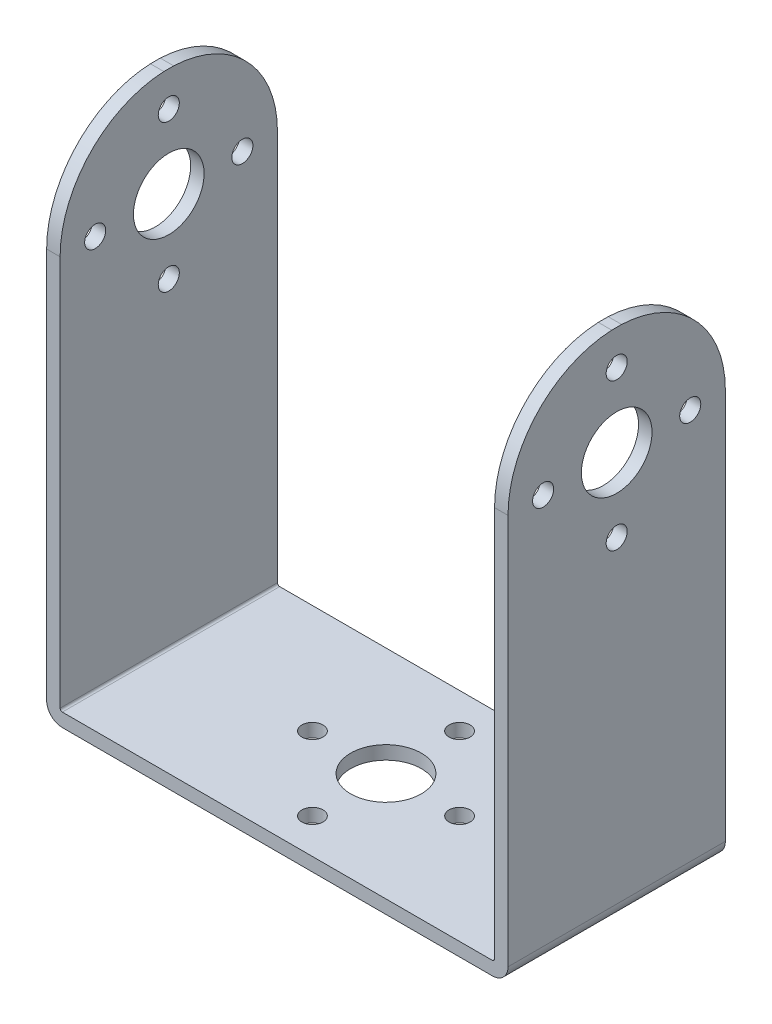
ISO-10303-21;
HEADER;
FILE_DESCRIPTION(('STEP AP214'),'2;1');
FILE_NAME('part.step','',(''),(''),'','','');
FILE_SCHEMA(('AUTOMOTIVE_DESIGN { 1 0 10303 214 1 1 1 1 }'));
ENDSEC;
DATA;
#1=APPLICATION_CONTEXT('core data for automotive mechanical design processes');
#2=APPLICATION_PROTOCOL_DEFINITION('international standard','automotive_design',2000,#1);
#3=PRODUCT_CONTEXT('',#1,'mechanical');
#4=PRODUCT('Part','Part','',(#3));
#5=PRODUCT_RELATED_PRODUCT_CATEGORY('part','',(#4));
#6=PRODUCT_DEFINITION_FORMATION('','',#4);
#7=PRODUCT_DEFINITION_CONTEXT('part definition',#1,'design');
#8=PRODUCT_DEFINITION('design','',#6,#7);
#9=PRODUCT_DEFINITION_SHAPE('','',#8);
#10=(LENGTH_UNIT() NAMED_UNIT(*) SI_UNIT(.MILLI.,.METRE.));
#11=(NAMED_UNIT(*) PLANE_ANGLE_UNIT() SI_UNIT($,.RADIAN.));
#12=(NAMED_UNIT(*) SI_UNIT($,.STERADIAN.) SOLID_ANGLE_UNIT());
#13=UNCERTAINTY_MEASURE_WITH_UNIT(LENGTH_MEASURE(1.E-05),#10,'distance_accuracy_value','');
#14=(GEOMETRIC_REPRESENTATION_CONTEXT(3) GLOBAL_UNCERTAINTY_ASSIGNED_CONTEXT((#13)) GLOBAL_UNIT_ASSIGNED_CONTEXT((#10,
#11,#12)) REPRESENTATION_CONTEXT('',''));
#15=CARTESIAN_POINT('',(0.,0.,0.));
#16=DIRECTION('',(0.,0.,1.));
#17=DIRECTION('',(1.,0.,0.));
#18=AXIS2_PLACEMENT_3D('',#15,#16,#17);
#19=CARTESIAN_POINT('',(-24.5999,58.3438,0.));
#20=DIRECTION('',(-1.,0.,0.));
#21=DIRECTION('',(0.,0.,1.));
#22=AXIS2_PLACEMENT_3D('',#19,#20,#21);
#23=PLANE('',#22);
#24=CARTESIAN_POINT('',(-24.5999,37.7317,0.));
#25=DIRECTION('',(-1.,0.,0.));
#26=DIRECTION('',(0.,0.,1.));
#27=AXIS2_PLACEMENT_3D('',#24,#25,#26);
#28=CIRCLE('',#27,1.1938);
#29=CARTESIAN_POINT('',(-24.5999,37.7317,1.1938));
#30=VERTEX_POINT('',#29);
#31=EDGE_CURVE('E472',#30,#30,#28,.T.);
#32=ORIENTED_EDGE('',*,*,#31,.T.);
#33=EDGE_LOOP('',(#32));
#34=FACE_BOUND('',#33,.T.);
#35=CARTESIAN_POINT('',(-24.5999,46.0629,8.3312));
#36=DIRECTION('',(-1.,0.,0.));
#37=DIRECTION('',(0.,0.,1.));
#38=AXIS2_PLACEMENT_3D('',#35,#36,#37);
#39=CIRCLE('',#38,1.1938);
#40=CARTESIAN_POINT('',(-24.5999,46.0629,9.525));
#41=VERTEX_POINT('',#40);
#42=EDGE_CURVE('E477',#41,#41,#39,.T.);
#43=ORIENTED_EDGE('',*,*,#42,.T.);
#44=EDGE_LOOP('',(#43));
#45=FACE_BOUND('',#44,.T.);
#46=CARTESIAN_POINT('',(-24.5999,54.3941,0.));
#47=DIRECTION('',(-1.,0.,0.));
#48=DIRECTION('',(0.,0.,1.));
#49=AXIS2_PLACEMENT_3D('',#46,#47,#48);
#50=CIRCLE('',#49,1.1938);
#51=CARTESIAN_POINT('',(-24.5999,54.3941,1.1938));
#52=VERTEX_POINT('',#51);
#53=EDGE_CURVE('E481',#52,#52,#50,.T.);
#54=ORIENTED_EDGE('',*,*,#53,.T.);
#55=EDGE_LOOP('',(#54));
#56=FACE_BOUND('',#55,.T.);
#57=CARTESIAN_POINT('',(-24.5999,46.0629,-8.3312));
#58=DIRECTION('',(-1.,0.,0.));
#59=DIRECTION('',(0.,0.,1.));
#60=AXIS2_PLACEMENT_3D('',#57,#58,#59);
#61=CIRCLE('',#60,1.1938);
#62=CARTESIAN_POINT('',(-24.5999,46.0629,-7.1374));
#63=VERTEX_POINT('',#62);
#64=EDGE_CURVE('E485',#63,#63,#61,.T.);
#65=ORIENTED_EDGE('',*,*,#64,.T.);
#66=EDGE_LOOP('',(#65));
#67=FACE_BOUND('',#66,.T.);
#68=CARTESIAN_POINT('',(-24.5999,46.0629,0.));
#69=DIRECTION('',(-1.,0.,0.));
#70=DIRECTION('',(0.,0.,1.));
#71=AXIS2_PLACEMENT_3D('',#68,#69,#70);
#72=CIRCLE('',#71,4.0005);
#73=CARTESIAN_POINT('',(-24.5999,46.0629,4.0005));
#74=VERTEX_POINT('',#73);
#75=EDGE_CURVE('E502',#74,#74,#72,.T.);
#76=ORIENTED_EDGE('',*,*,#75,.T.);
#77=EDGE_LOOP('',(#76));
#78=FACE_BOUND('',#77,.T.);
#79=DIRECTION('',(0.,-1.,0.));
#80=VECTOR('',#79,1.);
#81=CARTESIAN_POINT('',(-24.5999,58.3438,12.3063));
#82=LINE('',#81,#80);
#83=CARTESIAN_POINT('',(-24.5999,46.0502,12.3063));
#84=VERTEX_POINT('',#83);
#85=CARTESIAN_POINT('',(-24.5999,1.778,12.3063));
#86=VERTEX_POINT('',#85);
#87=EDGE_CURVE('E338',#84,#86,#82,.T.);
#88=ORIENTED_EDGE('',*,*,#87,.T.);
#89=DIRECTION('',(0.,0.,-1.));
#90=VECTOR('',#89,1.);
#91=CARTESIAN_POINT('',(-24.5999,1.778,0.));
#92=LINE('',#91,#90);
#93=CARTESIAN_POINT('',(-24.5999,1.778,-12.3063));
#94=VERTEX_POINT('',#93);
#95=EDGE_CURVE('E390',#86,#94,#92,.T.);
#96=ORIENTED_EDGE('',*,*,#95,.T.);
#97=DIRECTION('',(0.,-1.,0.));
#98=VECTOR('',#97,1.);
#99=CARTESIAN_POINT('',(-24.5999,58.3438,-12.3063));
#100=LINE('',#99,#98);
#101=CARTESIAN_POINT('',(-24.5999,46.0502,-12.3063));
#102=VERTEX_POINT('',#101);
#103=EDGE_CURVE('E321',#102,#94,#100,.T.);
#104=ORIENTED_EDGE('',*,*,#103,.F.);
#105=CARTESIAN_POINT('',(-24.5999,46.0502,0.));
#106=DIRECTION('',(-1.,0.,0.));
#107=DIRECTION('',(0.,0.,1.));
#108=AXIS2_PLACEMENT_3D('',#105,#106,#107);
#109=CIRCLE('',#108,12.3063);
#110=CARTESIAN_POINT('',(-24.5999,58.3438,-0.558944299550435));
#111=VERTEX_POINT('',#110);
#112=EDGE_CURVE('E301',#111,#102,#109,.T.);
#113=ORIENTED_EDGE('',*,*,#112,.F.);
#114=DIRECTION('',(0.,0.,-1.));
#115=VECTOR('',#114,1.);
#116=CARTESIAN_POINT('',(-24.5999,58.3438,0.));
#117=LINE('',#116,#115);
#118=CARTESIAN_POINT('',(-24.5999,58.3438,0.558944299550435));
#119=VERTEX_POINT('',#118);
#120=EDGE_CURVE('E311',#119,#111,#117,.T.);
#121=ORIENTED_EDGE('',*,*,#120,.F.);
#122=CARTESIAN_POINT('',(-24.5999,46.0502,0.));
#123=DIRECTION('',(-1.,0.,0.));
#124=DIRECTION('',(0.,0.,1.));
#125=AXIS2_PLACEMENT_3D('',#122,#123,#124);
#126=CIRCLE('',#125,12.3063);
#127=EDGE_CURVE('E458',#84,#119,#126,.T.);
#128=ORIENTED_EDGE('',*,*,#127,.F.);
#129=EDGE_LOOP('',(#88,#96,#104,#113,#121,#128));
#130=FACE_BOUND('',#129,.T.);
#131=ADVANCED_FACE('F177',(#34,#45,#56,#67,#78,#130),#23,.F.);
#132=CARTESIAN_POINT('',(-26.1239,58.3438,0.));
#133=DIRECTION('',(1.,0.,0.));
#134=DIRECTION('',(0.,0.,-1.));
#135=AXIS2_PLACEMENT_3D('',#132,#133,#134);
#136=PLANE('',#135);
#137=CARTESIAN_POINT('',(-26.1239,37.7317,0.));
#138=DIRECTION('',(1.,0.,0.));
#139=DIRECTION('',(0.,0.,-1.));
#140=AXIS2_PLACEMENT_3D('',#137,#138,#139);
#141=CIRCLE('',#140,1.1938);
#142=CARTESIAN_POINT('',(-26.1239,37.7317,-1.1938));
#143=VERTEX_POINT('',#142);
#144=EDGE_CURVE('E914',#143,#143,#141,.T.);
#145=ORIENTED_EDGE('',*,*,#144,.T.);
#146=EDGE_LOOP('',(#145));
#147=FACE_BOUND('',#146,.T.);
#148=CARTESIAN_POINT('',(-26.1239,46.0629,8.3312));
#149=DIRECTION('',(1.,0.,0.));
#150=DIRECTION('',(0.,0.,-1.));
#151=AXIS2_PLACEMENT_3D('',#148,#149,#150);
#152=CIRCLE('',#151,1.1938);
#153=CARTESIAN_POINT('',(-26.1239,46.0629,7.1374));
#154=VERTEX_POINT('',#153);
#155=EDGE_CURVE('E908',#154,#154,#152,.T.);
#156=ORIENTED_EDGE('',*,*,#155,.T.);
#157=EDGE_LOOP('',(#156));
#158=FACE_BOUND('',#157,.T.);
#159=CARTESIAN_POINT('',(-26.1239,54.3941,0.));
#160=DIRECTION('',(1.,0.,0.));
#161=DIRECTION('',(0.,0.,-1.));
#162=AXIS2_PLACEMENT_3D('',#159,#160,#161);
#163=CIRCLE('',#162,1.1938);
#164=CARTESIAN_POINT('',(-26.1239,54.3941,-1.1938));
#165=VERTEX_POINT('',#164);
#166=EDGE_CURVE('E888',#165,#165,#163,.T.);
#167=ORIENTED_EDGE('',*,*,#166,.T.);
#168=EDGE_LOOP('',(#167));
#169=FACE_BOUND('',#168,.T.);
#170=CARTESIAN_POINT('',(-26.1239,46.0629,-8.3312));
#171=DIRECTION('',(1.,0.,0.));
#172=DIRECTION('',(0.,0.,-1.));
#173=AXIS2_PLACEMENT_3D('',#170,#171,#172);
#174=CIRCLE('',#173,1.1938);
#175=CARTESIAN_POINT('',(-26.1239,46.0629,-9.525));
#176=VERTEX_POINT('',#175);
#177=EDGE_CURVE('E492',#176,#176,#174,.T.);
#178=ORIENTED_EDGE('',*,*,#177,.T.);
#179=EDGE_LOOP('',(#178));
#180=FACE_BOUND('',#179,.T.);
#181=CARTESIAN_POINT('',(-26.1239,46.0629,0.));
#182=DIRECTION('',(1.,0.,0.));
#183=DIRECTION('',(0.,0.,-1.));
#184=AXIS2_PLACEMENT_3D('',#181,#182,#183);
#185=CIRCLE('',#184,4.0005);
#186=CARTESIAN_POINT('',(-26.1239,46.0629,-4.0005));
#187=VERTEX_POINT('',#186);
#188=EDGE_CURVE('E489',#187,#187,#185,.T.);
#189=ORIENTED_EDGE('',*,*,#188,.T.);
#190=EDGE_LOOP('',(#189));
#191=FACE_BOUND('',#190,.T.);
#192=DIRECTION('',(0.,-1.,0.));
#193=VECTOR('',#192,1.);
#194=CARTESIAN_POINT('',(-26.1239,58.3438,-12.3063));
#195=LINE('',#194,#193);
#196=CARTESIAN_POINT('',(-26.1239,46.0502,-12.3063));
#197=VERTEX_POINT('',#196);
#198=CARTESIAN_POINT('',(-26.1239,1.778,-12.3063));
#199=VERTEX_POINT('',#198);
#200=EDGE_CURVE('E447',#197,#199,#195,.T.);
#201=ORIENTED_EDGE('',*,*,#200,.T.);
#202=DIRECTION('',(0.,0.,1.));
#203=VECTOR('',#202,1.);
#204=CARTESIAN_POINT('',(-26.1239,1.778,0.));
#205=LINE('',#204,#203);
#206=CARTESIAN_POINT('',(-26.1239,1.778,12.3063));
#207=VERTEX_POINT('',#206);
#208=EDGE_CURVE('E372',#199,#207,#205,.T.);
#209=ORIENTED_EDGE('',*,*,#208,.T.);
#210=DIRECTION('',(0.,-1.,0.));
#211=VECTOR('',#210,1.);
#212=CARTESIAN_POINT('',(-26.1239,58.3438,12.3063));
#213=LINE('',#212,#211);
#214=CARTESIAN_POINT('',(-26.1239,46.0502,12.3063));
#215=VERTEX_POINT('',#214);
#216=EDGE_CURVE('E448',#215,#207,#213,.T.);
#217=ORIENTED_EDGE('',*,*,#216,.F.);
#218=CARTESIAN_POINT('',(-26.1239,46.0502,0.));
#219=DIRECTION('',(1.,0.,0.));
#220=DIRECTION('',(0.,0.,-1.));
#221=AXIS2_PLACEMENT_3D('',#218,#219,#220);
#222=CIRCLE('',#221,12.3063);
#223=CARTESIAN_POINT('',(-26.1239,58.3438,0.558944299550435));
#224=VERTEX_POINT('',#223);
#225=EDGE_CURVE('E318',#224,#215,#222,.T.);
#226=ORIENTED_EDGE('',*,*,#225,.F.);
#227=DIRECTION('',(0.,0.,1.));
#228=VECTOR('',#227,1.);
#229=CARTESIAN_POINT('',(-26.1239,58.3438,0.));
#230=LINE('',#229,#228);
#231=CARTESIAN_POINT('',(-26.1239,58.3438,-0.558944299550435));
#232=VERTEX_POINT('',#231);
#233=EDGE_CURVE('E308',#232,#224,#230,.T.);
#234=ORIENTED_EDGE('',*,*,#233,.F.);
#235=CARTESIAN_POINT('',(-26.1239,46.0502,0.));
#236=DIRECTION('',(1.,0.,0.));
#237=DIRECTION('',(0.,0.,-1.));
#238=AXIS2_PLACEMENT_3D('',#235,#236,#237);
#239=CIRCLE('',#238,12.3063);
#240=EDGE_CURVE('E290',#197,#232,#239,.T.);
#241=ORIENTED_EDGE('',*,*,#240,.F.);
#242=EDGE_LOOP('',(#201,#209,#217,#226,#234,#241));
#243=FACE_BOUND('',#242,.T.);
#244=ADVANCED_FACE('F316',(#147,#158,#169,#180,#191,#243),#136,.F.);
#245=CARTESIAN_POINT('',(-45.0640846074071,58.3438,0.));
#246=DIRECTION('',(0.,1.,0.));
#247=DIRECTION('',(0.,0.,1.));
#248=AXIS2_PLACEMENT_3D('',#245,#246,#247);
#249=PLANE('',#248);
#250=ORIENTED_EDGE('',*,*,#120,.T.);
#251=DIRECTION('',(1.,0.,0.));
#252=VECTOR('',#251,1.);
#253=CARTESIAN_POINT('',(-40.8686,58.3438,-0.558944299550435));
#254=LINE('',#253,#252);
#255=EDGE_CURVE('E293',#232,#111,#254,.T.);
#256=ORIENTED_EDGE('',*,*,#255,.F.);
#257=ORIENTED_EDGE('',*,*,#233,.T.);
#258=DIRECTION('',(1.,0.,0.));
#259=VECTOR('',#258,1.);
#260=CARTESIAN_POINT('',(-40.8686,58.3438,0.558944299550435));
#261=LINE('',#260,#259);
#262=EDGE_CURVE('E510',#224,#119,#261,.T.);
#263=ORIENTED_EDGE('',*,*,#262,.T.);
#264=EDGE_LOOP('',(#250,#256,#257,#263));
#265=FACE_BOUND('',#264,.T.);
#266=ADVANCED_FACE('F306',(#265),#249,.T.);
#267=CARTESIAN_POINT('',(24.5999,58.3438,0.));
#268=DIRECTION('',(-1.,0.,0.));
#269=DIRECTION('',(0.,0.,1.));
#270=AXIS2_PLACEMENT_3D('',#267,#268,#269);
#271=PLANE('',#270);
#272=CARTESIAN_POINT('',(24.5999,37.7317,0.));
#273=DIRECTION('',(-1.,0.,0.));
#274=DIRECTION('',(0.,0.,1.));
#275=AXIS2_PLACEMENT_3D('',#272,#273,#274);
#276=CIRCLE('',#275,1.1938);
#277=CARTESIAN_POINT('',(24.5999,37.7317,1.1938));
#278=VERTEX_POINT('',#277);
#279=EDGE_CURVE('E467',#278,#278,#276,.T.);
#280=ORIENTED_EDGE('',*,*,#279,.F.);
#281=EDGE_LOOP('',(#280));
#282=FACE_BOUND('',#281,.T.);
#283=CARTESIAN_POINT('',(24.5999,46.0629,8.3312));
#284=DIRECTION('',(-1.,0.,0.));
#285=DIRECTION('',(0.,0.,1.));
#286=AXIS2_PLACEMENT_3D('',#283,#284,#285);
#287=CIRCLE('',#286,1.1938);
#288=CARTESIAN_POINT('',(24.5999,46.0629,9.525));
#289=VERTEX_POINT('',#288);
#290=EDGE_CURVE('E471',#289,#289,#287,.T.);
#291=ORIENTED_EDGE('',*,*,#290,.F.);
#292=EDGE_LOOP('',(#291));
#293=FACE_BOUND('',#292,.T.);
#294=CARTESIAN_POINT('',(24.5999,54.3941,0.));
#295=DIRECTION('',(-1.,0.,0.));
#296=DIRECTION('',(0.,0.,1.));
#297=AXIS2_PLACEMENT_3D('',#294,#295,#296);
#298=CIRCLE('',#297,1.1938);
#299=CARTESIAN_POINT('',(24.5999,54.3941,1.1938));
#300=VERTEX_POINT('',#299);
#301=EDGE_CURVE('E476',#300,#300,#298,.T.);
#302=ORIENTED_EDGE('',*,*,#301,.F.);
#303=EDGE_LOOP('',(#302));
#304=FACE_BOUND('',#303,.T.);
#305=CARTESIAN_POINT('',(24.5999,46.0629,-8.3312));
#306=DIRECTION('',(-1.,0.,0.));
#307=DIRECTION('',(0.,0.,1.));
#308=AXIS2_PLACEMENT_3D('',#305,#306,#307);
#309=CIRCLE('',#308,1.1938);
#310=CARTESIAN_POINT('',(24.5999,46.0629,-7.1374));
#311=VERTEX_POINT('',#310);
#312=EDGE_CURVE('E480',#311,#311,#309,.T.);
#313=ORIENTED_EDGE('',*,*,#312,.F.);
#314=EDGE_LOOP('',(#313));
#315=FACE_BOUND('',#314,.T.);
#316=CARTESIAN_POINT('',(24.5999,46.0629,0.));
#317=DIRECTION('',(-1.,0.,0.));
#318=DIRECTION('',(0.,0.,1.));
#319=AXIS2_PLACEMENT_3D('',#316,#317,#318);
#320=CIRCLE('',#319,4.0005);
#321=CARTESIAN_POINT('',(24.5999,46.0629,4.0005));
#322=VERTEX_POINT('',#321);
#323=EDGE_CURVE('E484',#322,#322,#320,.T.);
#324=ORIENTED_EDGE('',*,*,#323,.F.);
#325=EDGE_LOOP('',(#324));
#326=FACE_BOUND('',#325,.T.);
#327=DIRECTION('',(0.,-1.,0.));
#328=VECTOR('',#327,1.);
#329=CARTESIAN_POINT('',(24.5999,58.3438,-12.3063));
#330=LINE('',#329,#328);
#331=CARTESIAN_POINT('',(24.5999,46.0502,-12.3063));
#332=VERTEX_POINT('',#331);
#333=CARTESIAN_POINT('',(24.5999,1.778,-12.3063));
#334=VERTEX_POINT('',#333);
#335=EDGE_CURVE('E339',#332,#334,#330,.T.);
#336=ORIENTED_EDGE('',*,*,#335,.T.);
#337=DIRECTION('',(0.,0.,-1.));
#338=VECTOR('',#337,1.);
#339=CARTESIAN_POINT('',(24.5999,1.778,12.3063));
#340=LINE('',#339,#338);
#341=CARTESIAN_POINT('',(24.5999,1.778,12.3063));
#342=VERTEX_POINT('',#341);
#343=EDGE_CURVE('E383',#334,#342,#340,.F.);
#344=ORIENTED_EDGE('',*,*,#343,.T.);
#345=DIRECTION('',(0.,-1.,0.));
#346=VECTOR('',#345,1.);
#347=CARTESIAN_POINT('',(24.5999,58.3438,12.3063));
#348=LINE('',#347,#346);
#349=CARTESIAN_POINT('',(24.5999,46.0502,12.3063));
#350=VERTEX_POINT('',#349);
#351=EDGE_CURVE('E319',#350,#342,#348,.T.);
#352=ORIENTED_EDGE('',*,*,#351,.F.);
#353=CARTESIAN_POINT('',(24.5999,46.0502,0.));
#354=DIRECTION('',(-1.,0.,0.));
#355=DIRECTION('',(0.,0.,1.));
#356=AXIS2_PLACEMENT_3D('',#353,#354,#355);
#357=CIRCLE('',#356,12.3063);
#358=CARTESIAN_POINT('',(24.5999,58.3438,0.558944299550435));
#359=VERTEX_POINT('',#358);
#360=EDGE_CURVE('E516',#350,#359,#357,.T.);
#361=ORIENTED_EDGE('',*,*,#360,.T.);
#362=DIRECTION('',(0.,0.,-1.));
#363=VECTOR('',#362,1.);
#364=CARTESIAN_POINT('',(24.5999,58.3438,0.));
#365=LINE('',#364,#363);
#366=CARTESIAN_POINT('',(24.5999,58.3438,-0.558944299550435));
#367=VERTEX_POINT('',#366);
#368=EDGE_CURVE('E520',#359,#367,#365,.T.);
#369=ORIENTED_EDGE('',*,*,#368,.T.);
#370=CARTESIAN_POINT('',(24.5999,46.0502,0.));
#371=DIRECTION('',(-1.,0.,0.));
#372=DIRECTION('',(0.,0.,1.));
#373=AXIS2_PLACEMENT_3D('',#370,#371,#372);
#374=CIRCLE('',#373,12.3063);
#375=EDGE_CURVE('E302',#367,#332,#374,.T.);
#376=ORIENTED_EDGE('',*,*,#375,.T.);
#377=EDGE_LOOP('',(#336,#344,#352,#361,#369,#376));
#378=FACE_BOUND('',#377,.T.);
#379=ADVANCED_FACE('F529',(#282,#293,#304,#315,#326,#378),#271,.T.);
#380=CARTESIAN_POINT('',(26.1239,58.3438,0.));
#381=DIRECTION('',(1.,0.,0.));
#382=DIRECTION('',(0.,0.,-1.));
#383=AXIS2_PLACEMENT_3D('',#380,#381,#382);
#384=PLANE('',#383);
#385=CARTESIAN_POINT('',(26.1239,37.7317,0.));
#386=DIRECTION('',(1.,0.,0.));
#387=DIRECTION('',(0.,0.,-1.));
#388=AXIS2_PLACEMENT_3D('',#385,#386,#387);
#389=CIRCLE('',#388,1.1938);
#390=CARTESIAN_POINT('',(26.1239,37.7317,-1.1938));
#391=VERTEX_POINT('',#390);
#392=EDGE_CURVE('E464',#391,#391,#389,.T.);
#393=ORIENTED_EDGE('',*,*,#392,.F.);
#394=EDGE_LOOP('',(#393));
#395=FACE_BOUND('',#394,.T.);
#396=CARTESIAN_POINT('',(26.1239,46.0629,8.3312));
#397=DIRECTION('',(1.,0.,0.));
#398=DIRECTION('',(0.,0.,-1.));
#399=AXIS2_PLACEMENT_3D('',#396,#397,#398);
#400=CIRCLE('',#399,1.1938);
#401=CARTESIAN_POINT('',(26.1239,46.0629,7.1374));
#402=VERTEX_POINT('',#401);
#403=EDGE_CURVE('E468',#402,#402,#400,.T.);
#404=ORIENTED_EDGE('',*,*,#403,.F.);
#405=EDGE_LOOP('',(#404));
#406=FACE_BOUND('',#405,.T.);
#407=CARTESIAN_POINT('',(26.1239,54.3941,0.));
#408=DIRECTION('',(1.,0.,0.));
#409=DIRECTION('',(0.,0.,-1.));
#410=AXIS2_PLACEMENT_3D('',#407,#408,#409);
#411=CIRCLE('',#410,1.1938);
#412=CARTESIAN_POINT('',(26.1239,54.3941,-1.1938));
#413=VERTEX_POINT('',#412);
#414=EDGE_CURVE('E473',#413,#413,#411,.T.);
#415=ORIENTED_EDGE('',*,*,#414,.F.);
#416=EDGE_LOOP('',(#415));
#417=FACE_BOUND('',#416,.T.);
#418=CARTESIAN_POINT('',(26.1239,46.0629,-8.3312));
#419=DIRECTION('',(1.,0.,0.));
#420=DIRECTION('',(0.,0.,-1.));
#421=AXIS2_PLACEMENT_3D('',#418,#419,#420);
#422=CIRCLE('',#421,1.1938);
#423=CARTESIAN_POINT('',(26.1239,46.0629,-9.525));
#424=VERTEX_POINT('',#423);
#425=EDGE_CURVE('E478',#424,#424,#422,.T.);
#426=ORIENTED_EDGE('',*,*,#425,.F.);
#427=EDGE_LOOP('',(#426));
#428=FACE_BOUND('',#427,.T.);
#429=CARTESIAN_POINT('',(26.1239,46.0629,0.));
#430=DIRECTION('',(1.,0.,0.));
#431=DIRECTION('',(0.,0.,-1.));
#432=AXIS2_PLACEMENT_3D('',#429,#430,#431);
#433=CIRCLE('',#432,4.0005);
#434=CARTESIAN_POINT('',(26.1239,46.0629,-4.0005));
#435=VERTEX_POINT('',#434);
#436=EDGE_CURVE('E482',#435,#435,#433,.T.);
#437=ORIENTED_EDGE('',*,*,#436,.F.);
#438=EDGE_LOOP('',(#437));
#439=FACE_BOUND('',#438,.T.);
#440=DIRECTION('',(0.,-1.,0.));
#441=VECTOR('',#440,1.);
#442=CARTESIAN_POINT('',(26.1239,58.3438,12.3063));
#443=LINE('',#442,#441);
#444=CARTESIAN_POINT('',(26.1239,46.0502,12.3063));
#445=VERTEX_POINT('',#444);
#446=CARTESIAN_POINT('',(26.1239,1.778,12.3063));
#447=VERTEX_POINT('',#446);
#448=EDGE_CURVE('E324',#445,#447,#443,.T.);
#449=ORIENTED_EDGE('',*,*,#448,.T.);
#450=DIRECTION('',(0.,0.,1.));
#451=VECTOR('',#450,1.);
#452=CARTESIAN_POINT('',(26.1239,1.778,-12.3063));
#453=LINE('',#452,#451);
#454=CARTESIAN_POINT('',(26.1239,1.778,-12.3063));
#455=VERTEX_POINT('',#454);
#456=EDGE_CURVE('E12',#447,#455,#453,.F.);
#457=ORIENTED_EDGE('',*,*,#456,.T.);
#458=DIRECTION('',(0.,-1.,0.));
#459=VECTOR('',#458,1.);
#460=CARTESIAN_POINT('',(26.1239,58.3438,-12.3063));
#461=LINE('',#460,#459);
#462=CARTESIAN_POINT('',(26.1239,46.0502,-12.3063));
#463=VERTEX_POINT('',#462);
#464=EDGE_CURVE('E343',#463,#455,#461,.T.);
#465=ORIENTED_EDGE('',*,*,#464,.F.);
#466=CARTESIAN_POINT('',(26.1239,46.0502,0.));
#467=DIRECTION('',(1.,0.,0.));
#468=DIRECTION('',(0.,0.,-1.));
#469=AXIS2_PLACEMENT_3D('',#466,#467,#468);
#470=CIRCLE('',#469,12.3063);
#471=CARTESIAN_POINT('',(26.1239,58.3438,-0.558944299550435));
#472=VERTEX_POINT('',#471);
#473=EDGE_CURVE('E312',#463,#472,#470,.T.);
#474=ORIENTED_EDGE('',*,*,#473,.T.);
#475=DIRECTION('',(0.,0.,1.));
#476=VECTOR('',#475,1.);
#477=CARTESIAN_POINT('',(26.1239,58.3438,0.));
#478=LINE('',#477,#476);
#479=CARTESIAN_POINT('',(26.1239,58.3438,0.558944299550435));
#480=VERTEX_POINT('',#479);
#481=EDGE_CURVE('E344',#472,#480,#478,.T.);
#482=ORIENTED_EDGE('',*,*,#481,.T.);
#483=CARTESIAN_POINT('',(26.1239,46.0502,0.));
#484=DIRECTION('',(1.,0.,0.));
#485=DIRECTION('',(0.,0.,-1.));
#486=AXIS2_PLACEMENT_3D('',#483,#484,#485);
#487=CIRCLE('',#486,12.3063);
#488=EDGE_CURVE('E355',#480,#445,#487,.T.);
#489=ORIENTED_EDGE('',*,*,#488,.T.);
#490=EDGE_LOOP('',(#449,#457,#465,#474,#482,#489));
#491=FACE_BOUND('',#490,.T.);
#492=ADVANCED_FACE('F353',(#395,#406,#417,#428,#439,#491),#384,.T.);
#493=CARTESIAN_POINT('',(-45.0640846074071,58.3438,0.));
#494=DIRECTION('',(0.,1.,0.));
#495=DIRECTION('',(0.,0.,1.));
#496=AXIS2_PLACEMENT_3D('',#493,#494,#495);
#497=PLANE('',#496);
#498=ORIENTED_EDGE('',*,*,#481,.F.);
#499=EDGE_CURVE('E313',#367,#472,#254,.T.);
#500=ORIENTED_EDGE('',*,*,#499,.F.);
#501=ORIENTED_EDGE('',*,*,#368,.F.);
#502=DIRECTION('',(1.,0.,0.));
#503=VECTOR('',#502,1.);
#504=CARTESIAN_POINT('',(-40.8686,58.3438,0.558944299550435));
#505=LINE('',#504,#503);
#506=EDGE_CURVE('E405',#359,#480,#505,.T.);
#507=ORIENTED_EDGE('',*,*,#506,.T.);
#508=EDGE_LOOP('',(#498,#500,#501,#507));
#509=FACE_BOUND('',#508,.T.);
#510=ADVANCED_FACE('F593',(#509),#497,.T.);
#511=CARTESIAN_POINT('',(-45.0640846074071,1.524,-12.3063));
#512=DIRECTION('',(0.,0.,-1.));
#513=DIRECTION('',(-1.,0.,0.));
#514=AXIS2_PLACEMENT_3D('',#511,#512,#513);
#515=PLANE('',#514);
#516=DIRECTION('',(1.,0.,0.));
#517=VECTOR('',#516,1.);
#518=CARTESIAN_POINT('',(-45.0640846074071,0.,-12.3063));
#519=LINE('',#518,#517);
#520=CARTESIAN_POINT('',(-24.3459,0.,-12.3063));
#521=VERTEX_POINT('',#520);
#522=CARTESIAN_POINT('',(24.3459,0.,-12.3063));
#523=VERTEX_POINT('',#522);
#524=EDGE_CURVE('E439',#521,#523,#519,.T.);
#525=ORIENTED_EDGE('',*,*,#524,.F.);
#526=CARTESIAN_POINT('',(-24.3459,1.778,-12.3063));
#527=DIRECTION('',(0.,0.,-1.));
#528=DIRECTION('',(-1.,0.,0.));
#529=AXIS2_PLACEMENT_3D('',#526,#527,#528);
#530=CIRCLE('',#529,1.778);
#531=EDGE_CURVE('E185',#521,#199,#530,.T.);
#532=ORIENTED_EDGE('',*,*,#531,.T.);
#533=ORIENTED_EDGE('',*,*,#200,.F.);
#534=DIRECTION('',(1.,0.,0.));
#535=VECTOR('',#534,1.);
#536=CARTESIAN_POINT('',(-40.8686,46.0502,-12.3063));
#537=LINE('',#536,#535);
#538=EDGE_CURVE('E296',#197,#102,#537,.T.);
#539=ORIENTED_EDGE('',*,*,#538,.T.);
#540=ORIENTED_EDGE('',*,*,#103,.T.);
#541=CARTESIAN_POINT('',(-24.3459,1.778,-12.3063));
#542=DIRECTION('',(0.,0.,-1.));
#543=DIRECTION('',(-1.,0.,0.));
#544=AXIS2_PLACEMENT_3D('',#541,#542,#543);
#545=CIRCLE('',#544,0.254);
#546=CARTESIAN_POINT('',(-24.3459,1.524,-12.3063));
#547=VERTEX_POINT('',#546);
#548=EDGE_CURVE('E381',#94,#547,#545,.F.);
#549=ORIENTED_EDGE('',*,*,#548,.T.);
#550=DIRECTION('',(1.,0.,0.));
#551=VECTOR('',#550,1.);
#552=CARTESIAN_POINT('',(-45.0640846074071,1.524,-12.3063));
#553=LINE('',#552,#551);
#554=CARTESIAN_POINT('',(24.3459,1.524,-12.3063));
#555=VERTEX_POINT('',#554);
#556=EDGE_CURVE('E391',#547,#555,#553,.T.);
#557=ORIENTED_EDGE('',*,*,#556,.T.);
#558=CARTESIAN_POINT('',(24.3459,1.778,-12.3063));
#559=DIRECTION('',(0.,0.,-1.));
#560=DIRECTION('',(-1.,0.,0.));
#561=AXIS2_PLACEMENT_3D('',#558,#559,#560);
#562=CIRCLE('',#561,0.254);
#563=EDGE_CURVE('E377',#555,#334,#562,.F.);
#564=ORIENTED_EDGE('',*,*,#563,.T.);
#565=ORIENTED_EDGE('',*,*,#335,.F.);
#566=EDGE_CURVE('E345',#332,#463,#537,.T.);
#567=ORIENTED_EDGE('',*,*,#566,.T.);
#568=ORIENTED_EDGE('',*,*,#464,.T.);
#569=CARTESIAN_POINT('',(24.3459,1.778,-12.3063));
#570=DIRECTION('',(0.,0.,-1.));
#571=DIRECTION('',(-1.,0.,0.));
#572=AXIS2_PLACEMENT_3D('',#569,#570,#571);
#573=CIRCLE('',#572,1.778);
#574=EDGE_CURVE('E197',#455,#523,#573,.T.);
#575=ORIENTED_EDGE('',*,*,#574,.T.);
#576=EDGE_LOOP('',(#525,#532,#533,#539,#540,#549,#557,#564,#565,#567,#568,#575));
#577=FACE_BOUND('',#576,.T.);
#578=ADVANCED_FACE('F541',(#577),#515,.T.);
#579=CARTESIAN_POINT('',(-45.0640846074071,1.524,12.3063));
#580=DIRECTION('',(0.,0.,1.));
#581=DIRECTION('',(1.,0.,0.));
#582=AXIS2_PLACEMENT_3D('',#579,#580,#581);
#583=PLANE('',#582);
#584=ORIENTED_EDGE('',*,*,#216,.T.);
#585=CARTESIAN_POINT('',(-24.3459,1.778,12.3063));
#586=DIRECTION('',(0.,0.,1.));
#587=DIRECTION('',(1.,0.,0.));
#588=AXIS2_PLACEMENT_3D('',#585,#586,#587);
#589=CIRCLE('',#588,1.778);
#590=CARTESIAN_POINT('',(-24.3459,0.,12.3063));
#591=VERTEX_POINT('',#590);
#592=EDGE_CURVE('E369',#207,#591,#589,.T.);
#593=ORIENTED_EDGE('',*,*,#592,.T.);
#594=DIRECTION('',(-1.,0.,0.));
#595=VECTOR('',#594,1.);
#596=CARTESIAN_POINT('',(-45.0640846074071,0.,12.3063));
#597=LINE('',#596,#595);
#598=CARTESIAN_POINT('',(24.3459,0.,12.3063));
#599=VERTEX_POINT('',#598);
#600=EDGE_CURVE('E441',#599,#591,#597,.T.);
#601=ORIENTED_EDGE('',*,*,#600,.F.);
#602=CARTESIAN_POINT('',(24.3459,1.778,12.3063));
#603=DIRECTION('',(0.,0.,1.));
#604=DIRECTION('',(1.,0.,0.));
#605=AXIS2_PLACEMENT_3D('',#602,#603,#604);
#606=CIRCLE('',#605,1.778);
#607=EDGE_CURVE('E361',#599,#447,#606,.T.);
#608=ORIENTED_EDGE('',*,*,#607,.T.);
#609=ORIENTED_EDGE('',*,*,#448,.F.);
#610=DIRECTION('',(1.,0.,0.));
#611=VECTOR('',#610,1.);
#612=CARTESIAN_POINT('',(-40.8686,46.0502,12.3063));
#613=LINE('',#612,#611);
#614=EDGE_CURVE('E511',#350,#445,#613,.T.);
#615=ORIENTED_EDGE('',*,*,#614,.F.);
#616=ORIENTED_EDGE('',*,*,#351,.T.);
#617=CARTESIAN_POINT('',(24.3459,1.778,12.3063));
#618=DIRECTION('',(0.,0.,1.));
#619=DIRECTION('',(1.,0.,0.));
#620=AXIS2_PLACEMENT_3D('',#617,#618,#619);
#621=CIRCLE('',#620,0.254);
#622=CARTESIAN_POINT('',(24.3459,1.524,12.3063));
#623=VERTEX_POINT('',#622);
#624=EDGE_CURVE('E375',#342,#623,#621,.F.);
#625=ORIENTED_EDGE('',*,*,#624,.T.);
#626=DIRECTION('',(-1.,0.,0.));
#627=VECTOR('',#626,1.);
#628=CARTESIAN_POINT('',(-45.0640846074071,1.524,12.3063));
#629=LINE('',#628,#627);
#630=CARTESIAN_POINT('',(-24.3459,1.524,12.3063));
#631=VERTEX_POINT('',#630);
#632=EDGE_CURVE('E396',#623,#631,#629,.T.);
#633=ORIENTED_EDGE('',*,*,#632,.T.);
#634=CARTESIAN_POINT('',(-24.3459,1.778,12.3063));
#635=DIRECTION('',(0.,0.,1.));
#636=DIRECTION('',(1.,0.,0.));
#637=AXIS2_PLACEMENT_3D('',#634,#635,#636);
#638=CIRCLE('',#637,0.254);
#639=EDGE_CURVE('E379',#631,#86,#638,.F.);
#640=ORIENTED_EDGE('',*,*,#639,.T.);
#641=ORIENTED_EDGE('',*,*,#87,.F.);
#642=EDGE_CURVE('E513',#215,#84,#613,.T.);
#643=ORIENTED_EDGE('',*,*,#642,.F.);
#644=EDGE_LOOP('',(#584,#593,#601,#608,#609,#615,#616,#625,#633,#640,#641,#643));
#645=FACE_BOUND('',#644,.T.);
#646=ADVANCED_FACE('F527',(#645),#583,.T.);
#647=CARTESIAN_POINT('',(0.,1.524,0.));
#648=DIRECTION('',(0.,-1.,0.));
#649=DIRECTION('',(0.,0.,-1.));
#650=AXIS2_PLACEMENT_3D('',#647,#648,#649);
#651=CYLINDRICAL_SURFACE('',#650,4.0005);
#652=CARTESIAN_POINT('',(0.,1.524,0.));
#653=DIRECTION('',(0.,1.,0.));
#654=DIRECTION('',(0.,0.,1.));
#655=AXIS2_PLACEMENT_3D('',#652,#653,#654);
#656=CIRCLE('',#655,4.0005);
#657=CARTESIAN_POINT('',(0.,1.524,4.0005));
#658=VERTEX_POINT('',#657);
#659=EDGE_CURVE('E412',#658,#658,#656,.T.);
#660=ORIENTED_EDGE('',*,*,#659,.T.);
#661=EDGE_LOOP('',(#660));
#662=FACE_BOUND('',#661,.T.);
#663=CARTESIAN_POINT('',(0.,0.,0.));
#664=DIRECTION('',(0.,1.,0.));
#665=DIRECTION('',(0.,0.,1.));
#666=AXIS2_PLACEMENT_3D('',#663,#664,#665);
#667=CIRCLE('',#666,4.0005);
#668=CARTESIAN_POINT('',(0.,0.,4.0005));
#669=VERTEX_POINT('',#668);
#670=EDGE_CURVE('E430',#669,#669,#667,.T.);
#671=ORIENTED_EDGE('',*,*,#670,.F.);
#672=EDGE_LOOP('',(#671));
#673=FACE_BOUND('',#672,.T.);
#674=ADVANCED_FACE('F811',(#662,#673),#651,.F.);
#675=CARTESIAN_POINT('',(-8.3312,1.524,0.));
#676=DIRECTION('',(0.,-1.,0.));
#677=DIRECTION('',(0.,0.,-1.));
#678=AXIS2_PLACEMENT_3D('',#675,#676,#677);
#679=CYLINDRICAL_SURFACE('',#678,1.1938);
#680=CARTESIAN_POINT('',(-8.3312,1.524,0.));
#681=DIRECTION('',(0.,1.,0.));
#682=DIRECTION('',(0.,0.,1.));
#683=AXIS2_PLACEMENT_3D('',#680,#681,#682);
#684=CIRCLE('',#683,1.1938);
#685=CARTESIAN_POINT('',(-8.3312,1.524,1.1938));
#686=VERTEX_POINT('',#685);
#687=EDGE_CURVE('E416',#686,#686,#684,.T.);
#688=ORIENTED_EDGE('',*,*,#687,.T.);
#689=EDGE_LOOP('',(#688));
#690=FACE_BOUND('',#689,.T.);
#691=CARTESIAN_POINT('',(-8.3312,0.,0.));
#692=DIRECTION('',(0.,1.,0.));
#693=DIRECTION('',(0.,0.,1.));
#694=AXIS2_PLACEMENT_3D('',#691,#692,#693);
#695=CIRCLE('',#694,1.1938);
#696=CARTESIAN_POINT('',(-8.3312,0.,1.1938));
#697=VERTEX_POINT('',#696);
#698=EDGE_CURVE('E433',#697,#697,#695,.T.);
#699=ORIENTED_EDGE('',*,*,#698,.F.);
#700=EDGE_LOOP('',(#699));
#701=FACE_BOUND('',#700,.T.);
#702=ADVANCED_FACE('F817',(#690,#701),#679,.F.);
#703=CARTESIAN_POINT('',(0.,1.524,-8.3312));
#704=DIRECTION('',(0.,-1.,0.));
#705=DIRECTION('',(0.,0.,-1.));
#706=AXIS2_PLACEMENT_3D('',#703,#704,#705);
#707=CYLINDRICAL_SURFACE('',#706,1.1938);
#708=CARTESIAN_POINT('',(0.,1.524,-8.3312));
#709=DIRECTION('',(0.,1.,0.));
#710=DIRECTION('',(0.,0.,1.));
#711=AXIS2_PLACEMENT_3D('',#708,#709,#710);
#712=CIRCLE('',#711,1.1938);
#713=CARTESIAN_POINT('',(0.,1.524,-7.1374));
#714=VERTEX_POINT('',#713);
#715=EDGE_CURVE('E395',#714,#714,#712,.T.);
#716=ORIENTED_EDGE('',*,*,#715,.T.);
#717=EDGE_LOOP('',(#716));
#718=FACE_BOUND('',#717,.T.);
#719=CARTESIAN_POINT('',(0.,0.,-8.3312));
#720=DIRECTION('',(0.,1.,0.));
#721=DIRECTION('',(0.,0.,1.));
#722=AXIS2_PLACEMENT_3D('',#719,#720,#721);
#723=CIRCLE('',#722,1.1938);
#724=CARTESIAN_POINT('',(0.,0.,-7.1374));
#725=VERTEX_POINT('',#724);
#726=EDGE_CURVE('E436',#725,#725,#723,.T.);
#727=ORIENTED_EDGE('',*,*,#726,.F.);
#728=EDGE_LOOP('',(#727));
#729=FACE_BOUND('',#728,.T.);
#730=ADVANCED_FACE('F572',(#718,#729),#707,.F.);
#731=CARTESIAN_POINT('',(0.,1.524,8.3312));
#732=DIRECTION('',(0.,-1.,0.));
#733=DIRECTION('',(0.,0.,-1.));
#734=AXIS2_PLACEMENT_3D('',#731,#732,#733);
#735=CYLINDRICAL_SURFACE('',#734,1.1938);
#736=CARTESIAN_POINT('',(0.,1.524,8.3312));
#737=DIRECTION('',(0.,1.,0.));
#738=DIRECTION('',(0.,0.,1.));
#739=AXIS2_PLACEMENT_3D('',#736,#737,#738);
#740=CIRCLE('',#739,1.1938);
#741=CARTESIAN_POINT('',(0.,1.524,9.525));
#742=VERTEX_POINT('',#741);
#743=EDGE_CURVE('E424',#742,#742,#740,.T.);
#744=ORIENTED_EDGE('',*,*,#743,.T.);
#745=EDGE_LOOP('',(#744));
#746=FACE_BOUND('',#745,.T.);
#747=CARTESIAN_POINT('',(0.,0.,8.3312));
#748=DIRECTION('',(0.,1.,0.));
#749=DIRECTION('',(0.,0.,1.));
#750=AXIS2_PLACEMENT_3D('',#747,#748,#749);
#751=CIRCLE('',#750,1.1938);
#752=CARTESIAN_POINT('',(0.,0.,9.525));
#753=VERTEX_POINT('',#752);
#754=EDGE_CURVE('E444',#753,#753,#751,.T.);
#755=ORIENTED_EDGE('',*,*,#754,.F.);
#756=EDGE_LOOP('',(#755));
#757=FACE_BOUND('',#756,.T.);
#758=ADVANCED_FACE('F179',(#746,#757),#735,.F.);
#759=CARTESIAN_POINT('',(8.3312,1.524,0.));
#760=DIRECTION('',(0.,-1.,0.));
#761=DIRECTION('',(0.,0.,-1.));
#762=AXIS2_PLACEMENT_3D('',#759,#760,#761);
#763=CYLINDRICAL_SURFACE('',#762,1.1938);
#764=CARTESIAN_POINT('',(8.3312,1.524,0.));
#765=DIRECTION('',(0.,1.,0.));
#766=DIRECTION('',(0.,0.,1.));
#767=AXIS2_PLACEMENT_3D('',#764,#765,#766);
#768=CIRCLE('',#767,1.1938);
#769=CARTESIAN_POINT('',(8.3312,1.524,1.1938));
#770=VERTEX_POINT('',#769);
#771=EDGE_CURVE('E401',#770,#770,#768,.F.);
#772=ORIENTED_EDGE('',*,*,#771,.F.);
#773=EDGE_LOOP('',(#772));
#774=FACE_BOUND('',#773,.T.);
#775=CARTESIAN_POINT('',(8.3312,0.,0.));
#776=DIRECTION('',(0.,1.,0.));
#777=DIRECTION('',(0.,0.,1.));
#778=AXIS2_PLACEMENT_3D('',#775,#776,#777);
#779=CIRCLE('',#778,1.1938);
#780=CARTESIAN_POINT('',(8.3312,0.,1.1938));
#781=VERTEX_POINT('',#780);
#782=EDGE_CURVE('E427',#781,#781,#779,.F.);
#783=ORIENTED_EDGE('',*,*,#782,.T.);
#784=EDGE_LOOP('',(#783));
#785=FACE_BOUND('',#784,.T.);
#786=ADVANCED_FACE('F562',(#774,#785),#763,.F.);
#787=CARTESIAN_POINT('',(-45.0640846074071,1.524,0.));
#788=DIRECTION('',(0.,1.,0.));
#789=DIRECTION('',(0.,0.,1.));
#790=AXIS2_PLACEMENT_3D('',#787,#788,#789);
#791=PLANE('',#790);
#792=ORIENTED_EDGE('',*,*,#743,.F.);
#793=EDGE_LOOP('',(#792));
#794=FACE_BOUND('',#793,.T.);
#795=ORIENTED_EDGE('',*,*,#556,.F.);
#796=DIRECTION('',(0.,0.,-1.));
#797=VECTOR('',#796,1.);
#798=CARTESIAN_POINT('',(-24.3459,1.524,0.));
#799=LINE('',#798,#797);
#800=EDGE_CURVE('E385',#547,#631,#799,.F.);
#801=ORIENTED_EDGE('',*,*,#800,.T.);
#802=ORIENTED_EDGE('',*,*,#632,.F.);
#803=DIRECTION('',(0.,0.,-1.));
#804=VECTOR('',#803,1.);
#805=CARTESIAN_POINT('',(24.3459,1.524,-12.3063));
#806=LINE('',#805,#804);
#807=EDGE_CURVE('E387',#623,#555,#806,.T.);
#808=ORIENTED_EDGE('',*,*,#807,.T.);
#809=EDGE_LOOP('',(#795,#801,#802,#808));
#810=FACE_BOUND('',#809,.T.);
#811=ORIENTED_EDGE('',*,*,#715,.F.);
#812=EDGE_LOOP('',(#811));
#813=FACE_BOUND('',#812,.T.);
#814=ORIENTED_EDGE('',*,*,#687,.F.);
#815=EDGE_LOOP('',(#814));
#816=FACE_BOUND('',#815,.T.);
#817=ORIENTED_EDGE('',*,*,#659,.F.);
#818=EDGE_LOOP('',(#817));
#819=FACE_BOUND('',#818,.T.);
#820=ORIENTED_EDGE('',*,*,#771,.T.);
#821=EDGE_LOOP('',(#820));
#822=FACE_BOUND('',#821,.T.);
#823=ADVANCED_FACE('F539',(#794,#810,#813,#816,#819,#822),#791,.T.);
#824=CARTESIAN_POINT('',(-45.0640846074071,0.,0.));
#825=DIRECTION('',(0.,1.,0.));
#826=DIRECTION('',(0.,0.,1.));
#827=AXIS2_PLACEMENT_3D('',#824,#825,#826);
#828=PLANE('',#827);
#829=ORIENTED_EDGE('',*,*,#754,.T.);
#830=EDGE_LOOP('',(#829));
#831=FACE_BOUND('',#830,.T.);
#832=ORIENTED_EDGE('',*,*,#600,.T.);
#833=DIRECTION('',(0.,0.,1.));
#834=VECTOR('',#833,1.);
#835=CARTESIAN_POINT('',(-24.3459,0.,0.));
#836=LINE('',#835,#834);
#837=EDGE_CURVE('E364',#591,#521,#836,.F.);
#838=ORIENTED_EDGE('',*,*,#837,.T.);
#839=ORIENTED_EDGE('',*,*,#524,.T.);
#840=DIRECTION('',(0.,0.,1.));
#841=VECTOR('',#840,1.);
#842=CARTESIAN_POINT('',(24.3459,0.,12.3063));
#843=LINE('',#842,#841);
#844=EDGE_CURVE('E363',#523,#599,#843,.T.);
#845=ORIENTED_EDGE('',*,*,#844,.T.);
#846=EDGE_LOOP('',(#832,#838,#839,#845));
#847=FACE_BOUND('',#846,.T.);
#848=ORIENTED_EDGE('',*,*,#726,.T.);
#849=EDGE_LOOP('',(#848));
#850=FACE_BOUND('',#849,.T.);
#851=ORIENTED_EDGE('',*,*,#698,.T.);
#852=EDGE_LOOP('',(#851));
#853=FACE_BOUND('',#852,.T.);
#854=ORIENTED_EDGE('',*,*,#670,.T.);
#855=EDGE_LOOP('',(#854));
#856=FACE_BOUND('',#855,.T.);
#857=ORIENTED_EDGE('',*,*,#782,.F.);
#858=EDGE_LOOP('',(#857));
#859=FACE_BOUND('',#858,.T.);
#860=ADVANCED_FACE('F549',(#831,#847,#850,#853,#856,#859),#828,.F.);
#861=CARTESIAN_POINT('',(-40.8686,46.0502,0.));
#862=DIRECTION('',(1.,0.,0.));
#863=DIRECTION('',(0.,0.,-1.));
#864=AXIS2_PLACEMENT_3D('',#861,#862,#863);
#865=CYLINDRICAL_SURFACE('',#864,12.3063);
#866=ORIENTED_EDGE('',*,*,#614,.T.);
#867=ORIENTED_EDGE('',*,*,#488,.F.);
#868=ORIENTED_EDGE('',*,*,#506,.F.);
#869=ORIENTED_EDGE('',*,*,#360,.F.);
#870=EDGE_LOOP('',(#866,#867,#868,#869));
#871=FACE_BOUND('',#870,.T.);
#872=ADVANCED_FACE('F525',(#871),#865,.T.);
#873=ORIENTED_EDGE('',*,*,#127,.T.);
#874=ORIENTED_EDGE('',*,*,#262,.F.);
#875=ORIENTED_EDGE('',*,*,#225,.T.);
#876=ORIENTED_EDGE('',*,*,#642,.T.);
#877=EDGE_LOOP('',(#873,#874,#875,#876));
#878=FACE_BOUND('',#877,.T.);
#879=ADVANCED_FACE('F599',(#878),#865,.T.);
#880=CARTESIAN_POINT('',(-40.8686,46.0502,0.));
#881=DIRECTION('',(1.,0.,0.));
#882=DIRECTION('',(0.,0.,-1.));
#883=AXIS2_PLACEMENT_3D('',#880,#881,#882);
#884=CYLINDRICAL_SURFACE('',#883,12.3063);
#885=ORIENTED_EDGE('',*,*,#499,.T.);
#886=ORIENTED_EDGE('',*,*,#473,.F.);
#887=ORIENTED_EDGE('',*,*,#566,.F.);
#888=ORIENTED_EDGE('',*,*,#375,.F.);
#889=EDGE_LOOP('',(#885,#886,#887,#888));
#890=FACE_BOUND('',#889,.T.);
#891=ADVANCED_FACE('F600',(#890),#884,.T.);
#892=ORIENTED_EDGE('',*,*,#112,.T.);
#893=ORIENTED_EDGE('',*,*,#538,.F.);
#894=ORIENTED_EDGE('',*,*,#240,.T.);
#895=ORIENTED_EDGE('',*,*,#255,.T.);
#896=EDGE_LOOP('',(#892,#893,#894,#895));
#897=FACE_BOUND('',#896,.T.);
#898=ADVANCED_FACE('F292',(#897),#884,.T.);
#899=CARTESIAN_POINT('',(-40.8686,46.0629,0.));
#900=DIRECTION('',(1.,0.,0.));
#901=DIRECTION('',(0.,0.,-1.));
#902=AXIS2_PLACEMENT_3D('',#899,#900,#901);
#903=CYLINDRICAL_SURFACE('',#902,4.0005);
#904=ORIENTED_EDGE('',*,*,#323,.T.);
#905=EDGE_LOOP('',(#904));
#906=FACE_BOUND('',#905,.T.);
#907=ORIENTED_EDGE('',*,*,#436,.T.);
#908=EDGE_LOOP('',(#907));
#909=FACE_BOUND('',#908,.T.);
#910=ADVANCED_FACE('F604',(#906,#909),#903,.F.);
#911=ORIENTED_EDGE('',*,*,#188,.F.);
#912=EDGE_LOOP('',(#911));
#913=FACE_BOUND('',#912,.T.);
#914=ORIENTED_EDGE('',*,*,#75,.F.);
#915=EDGE_LOOP('',(#914));
#916=FACE_BOUND('',#915,.T.);
#917=ADVANCED_FACE('F607',(#913,#916),#903,.F.);
#918=CARTESIAN_POINT('',(-40.8686,46.0629,-8.3312));
#919=DIRECTION('',(1.,0.,0.));
#920=DIRECTION('',(0.,0.,-1.));
#921=AXIS2_PLACEMENT_3D('',#918,#919,#920);
#922=CYLINDRICAL_SURFACE('',#921,1.1938);
#923=ORIENTED_EDGE('',*,*,#312,.T.);
#924=EDGE_LOOP('',(#923));
#925=FACE_BOUND('',#924,.T.);
#926=ORIENTED_EDGE('',*,*,#425,.T.);
#927=EDGE_LOOP('',(#926));
#928=FACE_BOUND('',#927,.T.);
#929=ADVANCED_FACE('F609',(#925,#928),#922,.F.);
#930=ORIENTED_EDGE('',*,*,#177,.F.);
#931=EDGE_LOOP('',(#930));
#932=FACE_BOUND('',#931,.T.);
#933=ORIENTED_EDGE('',*,*,#64,.F.);
#934=EDGE_LOOP('',(#933));
#935=FACE_BOUND('',#934,.T.);
#936=ADVANCED_FACE('F612',(#932,#935),#922,.F.);
#937=CARTESIAN_POINT('',(-40.8686,54.3941,0.));
#938=DIRECTION('',(1.,0.,0.));
#939=DIRECTION('',(0.,0.,-1.));
#940=AXIS2_PLACEMENT_3D('',#937,#938,#939);
#941=CYLINDRICAL_SURFACE('',#940,1.1938);
#942=ORIENTED_EDGE('',*,*,#301,.T.);
#943=EDGE_LOOP('',(#942));
#944=FACE_BOUND('',#943,.T.);
#945=ORIENTED_EDGE('',*,*,#414,.T.);
#946=EDGE_LOOP('',(#945));
#947=FACE_BOUND('',#946,.T.);
#948=ADVANCED_FACE('F614',(#944,#947),#941,.F.);
#949=ORIENTED_EDGE('',*,*,#166,.F.);
#950=EDGE_LOOP('',(#949));
#951=FACE_BOUND('',#950,.T.);
#952=ORIENTED_EDGE('',*,*,#53,.F.);
#953=EDGE_LOOP('',(#952));
#954=FACE_BOUND('',#953,.T.);
#955=ADVANCED_FACE('F617',(#951,#954),#941,.F.);
#956=CARTESIAN_POINT('',(-40.8686,46.0629,8.3312));
#957=DIRECTION('',(1.,0.,0.));
#958=DIRECTION('',(0.,0.,-1.));
#959=AXIS2_PLACEMENT_3D('',#956,#957,#958);
#960=CYLINDRICAL_SURFACE('',#959,1.1938);
#961=ORIENTED_EDGE('',*,*,#290,.T.);
#962=EDGE_LOOP('',(#961));
#963=FACE_BOUND('',#962,.T.);
#964=ORIENTED_EDGE('',*,*,#403,.T.);
#965=EDGE_LOOP('',(#964));
#966=FACE_BOUND('',#965,.T.);
#967=ADVANCED_FACE('F619',(#963,#966),#960,.F.);
#968=ORIENTED_EDGE('',*,*,#155,.F.);
#969=EDGE_LOOP('',(#968));
#970=FACE_BOUND('',#969,.T.);
#971=ORIENTED_EDGE('',*,*,#42,.F.);
#972=EDGE_LOOP('',(#971));
#973=FACE_BOUND('',#972,.T.);
#974=ADVANCED_FACE('F622',(#970,#973),#960,.F.);
#975=CARTESIAN_POINT('',(-40.8686,37.7317,0.));
#976=DIRECTION('',(1.,0.,0.));
#977=DIRECTION('',(0.,0.,-1.));
#978=AXIS2_PLACEMENT_3D('',#975,#976,#977);
#979=CYLINDRICAL_SURFACE('',#978,1.1938);
#980=ORIENTED_EDGE('',*,*,#279,.T.);
#981=EDGE_LOOP('',(#980));
#982=FACE_BOUND('',#981,.T.);
#983=ORIENTED_EDGE('',*,*,#392,.T.);
#984=EDGE_LOOP('',(#983));
#985=FACE_BOUND('',#984,.T.);
#986=ADVANCED_FACE('F624',(#982,#985),#979,.F.);
#987=ORIENTED_EDGE('',*,*,#144,.F.);
#988=EDGE_LOOP('',(#987));
#989=FACE_BOUND('',#988,.T.);
#990=ORIENTED_EDGE('',*,*,#31,.F.);
#991=EDGE_LOOP('',(#990));
#992=FACE_BOUND('',#991,.T.);
#993=ADVANCED_FACE('F627',(#989,#992),#979,.F.);
#994=CARTESIAN_POINT('',(-24.3459,1.778,0.));
#995=DIRECTION('',(0.,0.,-1.));
#996=DIRECTION('',(-1.,0.,0.));
#997=AXIS2_PLACEMENT_3D('',#994,#995,#996);
#998=CYLINDRICAL_SURFACE('',#997,0.254);
#999=ORIENTED_EDGE('',*,*,#639,.F.);
#1000=ORIENTED_EDGE('',*,*,#800,.F.);
#1001=ORIENTED_EDGE('',*,*,#548,.F.);
#1002=ORIENTED_EDGE('',*,*,#95,.F.);
#1003=EDGE_LOOP('',(#999,#1000,#1001,#1002));
#1004=FACE_BOUND('',#1003,.T.);
#1005=ADVANCED_FACE('F461',(#1004),#998,.F.);
#1006=CARTESIAN_POINT('',(24.3459,1.778,0.));
#1007=DIRECTION('',(0.,0.,1.));
#1008=DIRECTION('',(1.,0.,0.));
#1009=AXIS2_PLACEMENT_3D('',#1006,#1007,#1008);
#1010=CYLINDRICAL_SURFACE('',#1009,0.254);
#1011=ORIENTED_EDGE('',*,*,#624,.F.);
#1012=ORIENTED_EDGE('',*,*,#343,.F.);
#1013=ORIENTED_EDGE('',*,*,#563,.F.);
#1014=ORIENTED_EDGE('',*,*,#807,.F.);
#1015=EDGE_LOOP('',(#1011,#1012,#1013,#1014));
#1016=FACE_BOUND('',#1015,.T.);
#1017=ADVANCED_FACE('F533',(#1016),#1010,.F.);
#1018=CARTESIAN_POINT('',(-24.3459,1.778,0.));
#1019=DIRECTION('',(0.,0.,1.));
#1020=DIRECTION('',(1.,0.,0.));
#1021=AXIS2_PLACEMENT_3D('',#1018,#1019,#1020);
#1022=CYLINDRICAL_SURFACE('',#1021,1.778);
#1023=ORIENTED_EDGE('',*,*,#531,.F.);
#1024=ORIENTED_EDGE('',*,*,#837,.F.);
#1025=ORIENTED_EDGE('',*,*,#592,.F.);
#1026=ORIENTED_EDGE('',*,*,#208,.F.);
#1027=EDGE_LOOP('',(#1023,#1024,#1025,#1026));
#1028=FACE_BOUND('',#1027,.T.);
#1029=ADVANCED_FACE('F545',(#1028),#1022,.T.);
#1030=CARTESIAN_POINT('',(24.3459,1.778,0.));
#1031=DIRECTION('',(0.,0.,-1.));
#1032=DIRECTION('',(-1.,0.,0.));
#1033=AXIS2_PLACEMENT_3D('',#1030,#1031,#1032);
#1034=CYLINDRICAL_SURFACE('',#1033,1.778);
#1035=ORIENTED_EDGE('',*,*,#574,.F.);
#1036=ORIENTED_EDGE('',*,*,#456,.F.);
#1037=ORIENTED_EDGE('',*,*,#607,.F.);
#1038=ORIENTED_EDGE('',*,*,#844,.F.);
#1039=EDGE_LOOP('',(#1035,#1036,#1037,#1038));
#1040=FACE_BOUND('',#1039,.T.);
#1041=ADVANCED_FACE('F359',(#1040),#1034,.T.);
#1042=CLOSED_SHELL('',(#131,#244,#266,#379,#492,#510,#578,#646,#674,#702,#730,#758,#786,#823,
#860,#872,#879,#891,#898,#910,#917,#929,#936,#948,#955,#967,#974,#986,#993,#1005,#1017,#1029,#1041));
#1043=MANIFOLD_SOLID_BREP('B2',#1042);
#1044=ADVANCED_BREP_SHAPE_REPRESENTATION('',(#18,#1043),#14);
#1045=SHAPE_DEFINITION_REPRESENTATION(#9,#1044);
ENDSEC;
END-ISO-10303-21;
